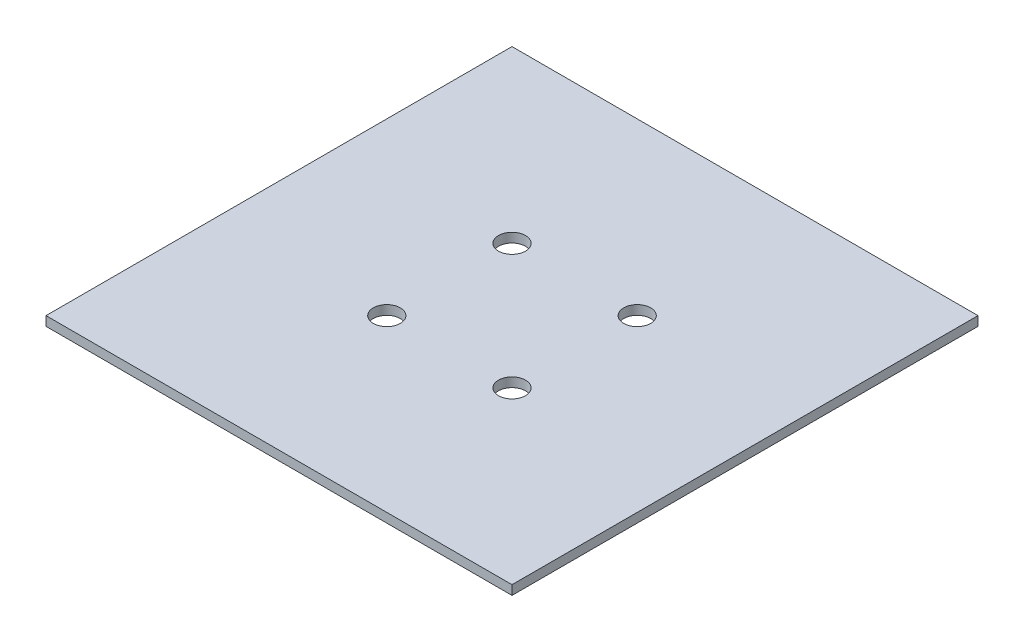
ISO-10303-21;
HEADER;
FILE_DESCRIPTION(('STEP AP214'),'2;1');
FILE_NAME('part.step','',(''),(''),'','','');
FILE_SCHEMA(('AUTOMOTIVE_DESIGN { 1 0 10303 214 1 1 1 1 }'));
ENDSEC;
DATA;
#1=APPLICATION_CONTEXT('core data for automotive mechanical design processes');
#2=APPLICATION_PROTOCOL_DEFINITION('international standard','automotive_design',2000,#1);
#3=PRODUCT_CONTEXT('',#1,'mechanical');
#4=PRODUCT('Part','Part','',(#3));
#5=PRODUCT_RELATED_PRODUCT_CATEGORY('part','',(#4));
#6=PRODUCT_DEFINITION_FORMATION('','',#4);
#7=PRODUCT_DEFINITION_CONTEXT('part definition',#1,'design');
#8=PRODUCT_DEFINITION('design','',#6,#7);
#9=PRODUCT_DEFINITION_SHAPE('','',#8);
#10=(LENGTH_UNIT() NAMED_UNIT(*) SI_UNIT(.MILLI.,.METRE.));
#11=(NAMED_UNIT(*) PLANE_ANGLE_UNIT() SI_UNIT($,.RADIAN.));
#12=(NAMED_UNIT(*) SI_UNIT($,.STERADIAN.) SOLID_ANGLE_UNIT());
#13=UNCERTAINTY_MEASURE_WITH_UNIT(LENGTH_MEASURE(1.E-05),#10,'distance_accuracy_value','');
#14=(GEOMETRIC_REPRESENTATION_CONTEXT(3) GLOBAL_UNCERTAINTY_ASSIGNED_CONTEXT((#13)) GLOBAL_UNIT_ASSIGNED_CONTEXT((#10,
#11,#12)) REPRESENTATION_CONTEXT('',''));
#15=CARTESIAN_POINT('',(0.,0.,0.));
#16=DIRECTION('',(0.,0.,1.));
#17=DIRECTION('',(1.,0.,0.));
#18=AXIS2_PLACEMENT_3D('',#15,#16,#17);
#19=CARTESIAN_POINT('',(25.,1.,-25.));
#20=DIRECTION('',(-1.,0.,0.));
#21=DIRECTION('',(0.,0.,1.));
#22=AXIS2_PLACEMENT_3D('',#19,#20,#21);
#23=PLANE('',#22);
#24=DIRECTION('',(0.,0.,-1.));
#25=VECTOR('',#24,1.);
#26=CARTESIAN_POINT('',(25.,0.,-25.));
#27=LINE('',#26,#25);
#28=CARTESIAN_POINT('',(25.,0.,25.));
#29=VERTEX_POINT('',#28);
#30=CARTESIAN_POINT('',(25.,0.,-25.));
#31=VERTEX_POINT('',#30);
#32=EDGE_CURVE('E97',#29,#31,#27,.T.);
#33=ORIENTED_EDGE('',*,*,#32,.T.);
#34=DIRECTION('',(0.,-1.,0.));
#35=VECTOR('',#34,1.);
#36=CARTESIAN_POINT('',(25.,1.,-25.));
#37=LINE('',#36,#35);
#38=CARTESIAN_POINT('',(25.,1.,-25.));
#39=VERTEX_POINT('',#38);
#40=EDGE_CURVE('E11',#39,#31,#37,.T.);
#41=ORIENTED_EDGE('',*,*,#40,.F.);
#42=DIRECTION('',(0.,0.,-1.));
#43=VECTOR('',#42,1.);
#44=CARTESIAN_POINT('',(25.,1.,-25.));
#45=LINE('',#44,#43);
#46=CARTESIAN_POINT('',(25.,1.,25.));
#47=VERTEX_POINT('',#46);
#48=EDGE_CURVE('E85',#47,#39,#45,.T.);
#49=ORIENTED_EDGE('',*,*,#48,.F.);
#50=DIRECTION('',(0.,-1.,0.));
#51=VECTOR('',#50,1.);
#52=CARTESIAN_POINT('',(25.,1.,25.));
#53=LINE('',#52,#51);
#54=EDGE_CURVE('E93',#47,#29,#53,.T.);
#55=ORIENTED_EDGE('',*,*,#54,.T.);
#56=EDGE_LOOP('',(#33,#41,#49,#55));
#57=FACE_BOUND('',#56,.T.);
#58=ADVANCED_FACE('F34',(#57),#23,.F.);
#59=CARTESIAN_POINT('',(-25.,1.,-25.));
#60=DIRECTION('',(0.,0.,1.));
#61=DIRECTION('',(1.,0.,0.));
#62=AXIS2_PLACEMENT_3D('',#59,#60,#61);
#63=PLANE('',#62);
#64=DIRECTION('',(-1.,0.,0.));
#65=VECTOR('',#64,1.);
#66=CARTESIAN_POINT('',(-25.,0.,-25.));
#67=LINE('',#66,#65);
#68=CARTESIAN_POINT('',(-25.,0.,-25.));
#69=VERTEX_POINT('',#68);
#70=EDGE_CURVE('E89',#31,#69,#67,.T.);
#71=ORIENTED_EDGE('',*,*,#70,.T.);
#72=DIRECTION('',(0.,-1.,0.));
#73=VECTOR('',#72,1.);
#74=CARTESIAN_POINT('',(-25.,1.,-25.));
#75=LINE('',#74,#73);
#76=CARTESIAN_POINT('',(-25.,1.,-25.));
#77=VERTEX_POINT('',#76);
#78=EDGE_CURVE('E42',#77,#69,#75,.T.);
#79=ORIENTED_EDGE('',*,*,#78,.F.);
#80=DIRECTION('',(-1.,0.,0.));
#81=VECTOR('',#80,1.);
#82=CARTESIAN_POINT('',(-25.,1.,-25.));
#83=LINE('',#82,#81);
#84=EDGE_CURVE('E80',#39,#77,#83,.T.);
#85=ORIENTED_EDGE('',*,*,#84,.F.);
#86=ORIENTED_EDGE('',*,*,#40,.T.);
#87=EDGE_LOOP('',(#71,#79,#85,#86));
#88=FACE_BOUND('',#87,.T.);
#89=ADVANCED_FACE('F88',(#88),#63,.F.);
#90=CARTESIAN_POINT('',(-25.,1.,-25.));
#91=DIRECTION('',(1.,0.,0.));
#92=DIRECTION('',(0.,0.,-1.));
#93=AXIS2_PLACEMENT_3D('',#90,#91,#92);
#94=PLANE('',#93);
#95=DIRECTION('',(0.,0.,1.));
#96=VECTOR('',#95,1.);
#97=CARTESIAN_POINT('',(-25.,0.,-25.));
#98=LINE('',#97,#96);
#99=CARTESIAN_POINT('',(-25.,0.,25.));
#100=VERTEX_POINT('',#99);
#101=EDGE_CURVE('E67',#69,#100,#98,.T.);
#102=ORIENTED_EDGE('',*,*,#101,.T.);
#103=DIRECTION('',(0.,-1.,0.));
#104=VECTOR('',#103,1.);
#105=CARTESIAN_POINT('',(-25.,1.,25.));
#106=LINE('',#105,#104);
#107=CARTESIAN_POINT('',(-25.,1.,25.));
#108=VERTEX_POINT('',#107);
#109=EDGE_CURVE('E90',#108,#100,#106,.T.);
#110=ORIENTED_EDGE('',*,*,#109,.F.);
#111=DIRECTION('',(0.,0.,1.));
#112=VECTOR('',#111,1.);
#113=CARTESIAN_POINT('',(-25.,1.,-25.));
#114=LINE('',#113,#112);
#115=EDGE_CURVE('E83',#77,#108,#114,.T.);
#116=ORIENTED_EDGE('',*,*,#115,.F.);
#117=ORIENTED_EDGE('',*,*,#78,.T.);
#118=EDGE_LOOP('',(#102,#110,#116,#117));
#119=FACE_BOUND('',#118,.T.);
#120=ADVANCED_FACE('F91',(#119),#94,.F.);
#121=CARTESIAN_POINT('',(-25.,1.,25.));
#122=DIRECTION('',(0.,0.,-1.));
#123=DIRECTION('',(-1.,0.,0.));
#124=AXIS2_PLACEMENT_3D('',#121,#122,#123);
#125=PLANE('',#124);
#126=DIRECTION('',(1.,0.,0.));
#127=VECTOR('',#126,1.);
#128=CARTESIAN_POINT('',(-25.,0.,25.));
#129=LINE('',#128,#127);
#130=EDGE_CURVE('E73',#100,#29,#129,.T.);
#131=ORIENTED_EDGE('',*,*,#130,.T.);
#132=ORIENTED_EDGE('',*,*,#54,.F.);
#133=DIRECTION('',(1.,0.,0.));
#134=VECTOR('',#133,1.);
#135=CARTESIAN_POINT('',(-25.,1.,25.));
#136=LINE('',#135,#134);
#137=EDGE_CURVE('E50',#108,#47,#136,.T.);
#138=ORIENTED_EDGE('',*,*,#137,.F.);
#139=ORIENTED_EDGE('',*,*,#109,.T.);
#140=EDGE_LOOP('',(#131,#132,#138,#139));
#141=FACE_BOUND('',#140,.T.);
#142=ADVANCED_FACE('F105',(#141),#125,.F.);
#143=CARTESIAN_POINT('',(0.,1.,0.));
#144=DIRECTION('',(0.,1.,0.));
#145=DIRECTION('',(0.,0.,1.));
#146=AXIS2_PLACEMENT_3D('',#143,#144,#145);
#147=PLANE('',#146);
#148=CARTESIAN_POINT('',(6.71751442127224,1.,-6.71751442127217));
#149=DIRECTION('',(0.,1.,0.));
#150=DIRECTION('',(0.,0.,1.));
#151=AXIS2_PLACEMENT_3D('',#148,#149,#150);
#152=CIRCLE('',#151,1.45);
#153=CARTESIAN_POINT('',(6.71751442127224,1.,-5.26751442127218));
#154=VERTEX_POINT('',#153);
#155=EDGE_CURVE('E117',#154,#154,#152,.F.);
#156=ORIENTED_EDGE('',*,*,#155,.T.);
#157=EDGE_LOOP('',(#156));
#158=FACE_BOUND('',#157,.T.);
#159=CARTESIAN_POINT('',(6.71751442127224,1.,6.71751442127215));
#160=DIRECTION('',(0.,1.,0.));
#161=DIRECTION('',(0.,0.,1.));
#162=AXIS2_PLACEMENT_3D('',#159,#160,#161);
#163=CIRCLE('',#162,1.45);
#164=CARTESIAN_POINT('',(6.71751442127224,1.,8.16751442127214));
#165=VERTEX_POINT('',#164);
#166=EDGE_CURVE('E124',#165,#165,#163,.F.);
#167=ORIENTED_EDGE('',*,*,#166,.T.);
#168=EDGE_LOOP('',(#167));
#169=FACE_BOUND('',#168,.T.);
#170=CARTESIAN_POINT('',(-6.71751442127224,1.,6.71751442127215));
#171=DIRECTION('',(0.,1.,0.));
#172=DIRECTION('',(0.,0.,1.));
#173=AXIS2_PLACEMENT_3D('',#170,#171,#172);
#174=CIRCLE('',#173,1.45);
#175=CARTESIAN_POINT('',(-6.71751442127224,1.,8.16751442127215));
#176=VERTEX_POINT('',#175);
#177=EDGE_CURVE('E116',#176,#176,#174,.F.);
#178=ORIENTED_EDGE('',*,*,#177,.T.);
#179=EDGE_LOOP('',(#178));
#180=FACE_BOUND('',#179,.T.);
#181=CARTESIAN_POINT('',(-6.71751442127223,1.,-6.71751442127218));
#182=DIRECTION('',(0.,1.,0.));
#183=DIRECTION('',(0.,0.,1.));
#184=AXIS2_PLACEMENT_3D('',#181,#182,#183);
#185=CIRCLE('',#184,1.45);
#186=CARTESIAN_POINT('',(-6.71751442127223,1.,-5.26751442127218));
#187=VERTEX_POINT('',#186);
#188=EDGE_CURVE('E100',#187,#187,#185,.F.);
#189=ORIENTED_EDGE('',*,*,#188,.T.);
#190=EDGE_LOOP('',(#189));
#191=FACE_BOUND('',#190,.T.);
#192=ORIENTED_EDGE('',*,*,#48,.T.);
#193=ORIENTED_EDGE('',*,*,#84,.T.);
#194=ORIENTED_EDGE('',*,*,#115,.T.);
#195=ORIENTED_EDGE('',*,*,#137,.T.);
#196=EDGE_LOOP('',(#192,#193,#194,#195));
#197=FACE_BOUND('',#196,.T.);
#198=ADVANCED_FACE('F81',(#158,#169,#180,#191,#197),#147,.T.);
#199=CARTESIAN_POINT('',(0.,0.,0.));
#200=DIRECTION('',(0.,1.,0.));
#201=DIRECTION('',(0.,0.,1.));
#202=AXIS2_PLACEMENT_3D('',#199,#200,#201);
#203=PLANE('',#202);
#204=CARTESIAN_POINT('',(6.71751442127224,0.,-6.71751442127217));
#205=DIRECTION('',(0.,-1.,0.));
#206=DIRECTION('',(0.,0.,-1.));
#207=AXIS2_PLACEMENT_3D('',#204,#205,#206);
#208=CIRCLE('',#207,1.45);
#209=CARTESIAN_POINT('',(6.71751442127224,0.,-8.16751442127217));
#210=VERTEX_POINT('',#209);
#211=EDGE_CURVE('E121',#210,#210,#208,.T.);
#212=ORIENTED_EDGE('',*,*,#211,.F.);
#213=EDGE_LOOP('',(#212));
#214=FACE_BOUND('',#213,.T.);
#215=CARTESIAN_POINT('',(6.71751442127224,0.,6.71751442127215));
#216=DIRECTION('',(0.,-1.,0.));
#217=DIRECTION('',(0.,0.,-1.));
#218=AXIS2_PLACEMENT_3D('',#215,#216,#217);
#219=CIRCLE('',#218,1.45);
#220=CARTESIAN_POINT('',(6.71751442127224,0.,5.26751442127215));
#221=VERTEX_POINT('',#220);
#222=EDGE_CURVE('E120',#221,#221,#219,.T.);
#223=ORIENTED_EDGE('',*,*,#222,.F.);
#224=EDGE_LOOP('',(#223));
#225=FACE_BOUND('',#224,.T.);
#226=CARTESIAN_POINT('',(-6.71751442127224,0.,6.71751442127215));
#227=DIRECTION('',(0.,-1.,0.));
#228=DIRECTION('',(0.,0.,-1.));
#229=AXIS2_PLACEMENT_3D('',#226,#227,#228);
#230=CIRCLE('',#229,1.45);
#231=CARTESIAN_POINT('',(-6.71751442127224,0.,5.26751442127215));
#232=VERTEX_POINT('',#231);
#233=EDGE_CURVE('E127',#232,#232,#230,.T.);
#234=ORIENTED_EDGE('',*,*,#233,.F.);
#235=EDGE_LOOP('',(#234));
#236=FACE_BOUND('',#235,.T.);
#237=CARTESIAN_POINT('',(-6.71751442127223,0.,-6.71751442127218));
#238=DIRECTION('',(0.,-1.,0.));
#239=DIRECTION('',(0.,0.,-1.));
#240=AXIS2_PLACEMENT_3D('',#237,#238,#239);
#241=CIRCLE('',#240,1.45);
#242=CARTESIAN_POINT('',(-6.71751442127223,0.,-8.16751442127218));
#243=VERTEX_POINT('',#242);
#244=EDGE_CURVE('E113',#243,#243,#241,.T.);
#245=ORIENTED_EDGE('',*,*,#244,.F.);
#246=EDGE_LOOP('',(#245));
#247=FACE_BOUND('',#246,.T.);
#248=ORIENTED_EDGE('',*,*,#32,.F.);
#249=ORIENTED_EDGE('',*,*,#130,.F.);
#250=ORIENTED_EDGE('',*,*,#101,.F.);
#251=ORIENTED_EDGE('',*,*,#70,.F.);
#252=EDGE_LOOP('',(#248,#249,#250,#251));
#253=FACE_BOUND('',#252,.T.);
#254=ADVANCED_FACE('F108',(#214,#225,#236,#247,#253),#203,.F.);
#255=CARTESIAN_POINT('',(-6.71751442127223,5.10121933088197,-6.71751442127218));
#256=DIRECTION('',(0.,-1.,0.));
#257=DIRECTION('',(0.,0.,-1.));
#258=AXIS2_PLACEMENT_3D('',#255,#256,#257);
#259=CYLINDRICAL_SURFACE('',#258,1.45);
#260=ORIENTED_EDGE('',*,*,#244,.T.);
#261=EDGE_LOOP('',(#260));
#262=FACE_BOUND('',#261,.T.);
#263=ORIENTED_EDGE('',*,*,#188,.F.);
#264=EDGE_LOOP('',(#263));
#265=FACE_BOUND('',#264,.T.);
#266=ADVANCED_FACE('F140',(#262,#265),#259,.F.);
#267=CARTESIAN_POINT('',(-6.71751442127224,5.10121933088197,6.71751442127215));
#268=DIRECTION('',(0.,-1.,0.));
#269=DIRECTION('',(0.,0.,-1.));
#270=AXIS2_PLACEMENT_3D('',#267,#268,#269);
#271=CYLINDRICAL_SURFACE('',#270,1.45);
#272=ORIENTED_EDGE('',*,*,#233,.T.);
#273=EDGE_LOOP('',(#272));
#274=FACE_BOUND('',#273,.T.);
#275=ORIENTED_EDGE('',*,*,#177,.F.);
#276=EDGE_LOOP('',(#275));
#277=FACE_BOUND('',#276,.T.);
#278=ADVANCED_FACE('F135',(#274,#277),#271,.F.);
#279=CARTESIAN_POINT('',(6.71751442127224,5.10121933088197,6.71751442127215));
#280=DIRECTION('',(0.,-1.,0.));
#281=DIRECTION('',(0.,0.,-1.));
#282=AXIS2_PLACEMENT_3D('',#279,#280,#281);
#283=CYLINDRICAL_SURFACE('',#282,1.45);
#284=ORIENTED_EDGE('',*,*,#222,.T.);
#285=EDGE_LOOP('',(#284));
#286=FACE_BOUND('',#285,.T.);
#287=ORIENTED_EDGE('',*,*,#166,.F.);
#288=EDGE_LOOP('',(#287));
#289=FACE_BOUND('',#288,.T.);
#290=ADVANCED_FACE('F192',(#286,#289),#283,.F.);
#291=CARTESIAN_POINT('',(6.71751442127224,5.10121933088197,-6.71751442127217));
#292=DIRECTION('',(0.,-1.,0.));
#293=DIRECTION('',(0.,0.,-1.));
#294=AXIS2_PLACEMENT_3D('',#291,#292,#293);
#295=CYLINDRICAL_SURFACE('',#294,1.45);
#296=ORIENTED_EDGE('',*,*,#211,.T.);
#297=EDGE_LOOP('',(#296));
#298=FACE_BOUND('',#297,.T.);
#299=ORIENTED_EDGE('',*,*,#155,.F.);
#300=EDGE_LOOP('',(#299));
#301=FACE_BOUND('',#300,.T.);
#302=ADVANCED_FACE('F199',(#298,#301),#295,.F.);
#303=CLOSED_SHELL('',(#58,#89,#120,#142,#198,#254,#266,#278,#290,#302));
#304=MANIFOLD_SOLID_BREP('B2',#303);
#305=ADVANCED_BREP_SHAPE_REPRESENTATION('',(#18,#304),#14);
#306=SHAPE_DEFINITION_REPRESENTATION(#9,#305);
ENDSEC;
END-ISO-10303-21;
